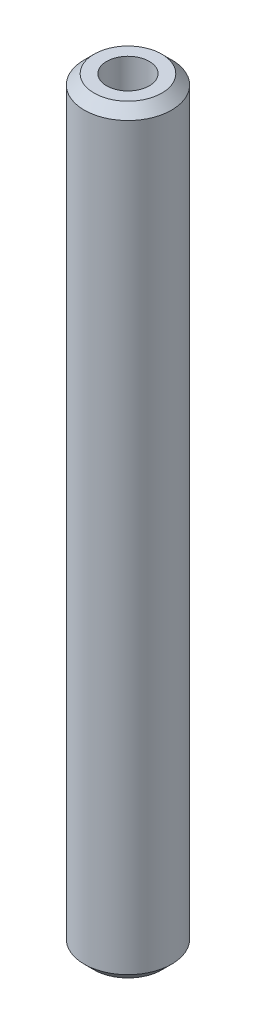
ISO-10303-21;
HEADER;
FILE_DESCRIPTION(('STEP AP214'),'2;1');
FILE_NAME('part.step','',(''),(''),'','','');
FILE_SCHEMA(('AUTOMOTIVE_DESIGN { 1 0 10303 214 1 1 1 1 }'));
ENDSEC;
DATA;
#1=APPLICATION_CONTEXT('core data for automotive mechanical design processes');
#2=APPLICATION_PROTOCOL_DEFINITION('international standard','automotive_design',2000,#1);
#3=PRODUCT_CONTEXT('',#1,'mechanical');
#4=PRODUCT('Part','Part','',(#3));
#5=PRODUCT_RELATED_PRODUCT_CATEGORY('part','',(#4));
#6=PRODUCT_DEFINITION_FORMATION('','',#4);
#7=PRODUCT_DEFINITION_CONTEXT('part definition',#1,'design');
#8=PRODUCT_DEFINITION('design','',#6,#7);
#9=PRODUCT_DEFINITION_SHAPE('','',#8);
#10=(LENGTH_UNIT() NAMED_UNIT(*) SI_UNIT(.MILLI.,.METRE.));
#11=(NAMED_UNIT(*) PLANE_ANGLE_UNIT() SI_UNIT($,.RADIAN.));
#12=(NAMED_UNIT(*) SI_UNIT($,.STERADIAN.) SOLID_ANGLE_UNIT());
#13=UNCERTAINTY_MEASURE_WITH_UNIT(LENGTH_MEASURE(1.E-05),#10,'distance_accuracy_value','');
#14=(GEOMETRIC_REPRESENTATION_CONTEXT(3) GLOBAL_UNCERTAINTY_ASSIGNED_CONTEXT((#13)) GLOBAL_UNIT_ASSIGNED_CONTEXT((#10,
#11,#12)) REPRESENTATION_CONTEXT('',''));
#15=CARTESIAN_POINT('',(0.,0.,0.));
#16=DIRECTION('',(0.,0.,1.));
#17=DIRECTION('',(1.,0.,0.));
#18=AXIS2_PLACEMENT_3D('',#15,#16,#17);
#19=CARTESIAN_POINT('',(0.,304.529368946112,0.));
#20=DIRECTION('',(0.,-1.,0.));
#21=DIRECTION('',(0.,0.,-1.));
#22=AXIS2_PLACEMENT_3D('',#19,#20,#21);
#23=CYLINDRICAL_SURFACE('',#22,17.5);
#24=CARTESIAN_POINT('',(0.,300.593678503799,0.));
#25=DIRECTION('',(0.,1.,0.));
#26=DIRECTION('',(0.,0.,1.));
#27=AXIS2_PLACEMENT_3D('',#24,#25,#26);
#28=CIRCLE('',#27,17.5);
#29=CARTESIAN_POINT('',(0.,300.593678503799,17.5));
#30=VERTEX_POINT('',#29);
#31=EDGE_CURVE('E50',#30,#30,#28,.F.);
#32=ORIENTED_EDGE('',*,*,#31,.T.);
#33=EDGE_LOOP('',(#32));
#34=FACE_BOUND('',#33,.T.);
#35=CARTESIAN_POINT('',(0.,3.93569044231279,0.));
#36=DIRECTION('',(0.,1.,0.));
#37=DIRECTION('',(0.,0.,1.));
#38=AXIS2_PLACEMENT_3D('',#35,#36,#37);
#39=CIRCLE('',#38,17.5);
#40=CARTESIAN_POINT('',(0.,3.93569044231279,17.5));
#41=VERTEX_POINT('',#40);
#42=EDGE_CURVE('E51',#41,#41,#39,.T.);
#43=ORIENTED_EDGE('',*,*,#42,.T.);
#44=EDGE_LOOP('',(#43));
#45=FACE_BOUND('',#44,.T.);
#46=ADVANCED_FACE('F39',(#34,#45),#23,.T.);
#47=CARTESIAN_POINT('',(0.,304.529368946112,0.));
#48=DIRECTION('',(0.,1.,0.));
#49=DIRECTION('',(0.,0.,1.));
#50=AXIS2_PLACEMENT_3D('',#47,#48,#49);
#51=PLANE('',#50);
#52=CARTESIAN_POINT('',(0.,304.529368946112,0.));
#53=DIRECTION('',(0.,1.,0.));
#54=DIRECTION('',(0.,0.,1.));
#55=AXIS2_PLACEMENT_3D('',#52,#53,#54);
#56=CIRCLE('',#55,13.5643095576873);
#57=CARTESIAN_POINT('',(0.,304.529368946112,13.5643095576873));
#58=VERTEX_POINT('',#57);
#59=EDGE_CURVE('E54',#58,#58,#56,.T.);
#60=ORIENTED_EDGE('',*,*,#59,.T.);
#61=EDGE_LOOP('',(#60));
#62=FACE_BOUND('',#61,.T.);
#63=CARTESIAN_POINT('',(0.,304.529368946112,0.));
#64=DIRECTION('',(0.,1.,0.));
#65=DIRECTION('',(0.,0.,1.));
#66=AXIS2_PLACEMENT_3D('',#63,#64,#65);
#67=CIRCLE('',#66,8.53633033487855);
#68=CARTESIAN_POINT('',(0.,304.529368946112,8.53633033487855));
#69=VERTEX_POINT('',#68);
#70=EDGE_CURVE('E58',#69,#69,#67,.T.);
#71=ORIENTED_EDGE('',*,*,#70,.F.);
#72=EDGE_LOOP('',(#71));
#73=FACE_BOUND('',#72,.T.);
#74=ADVANCED_FACE('F69',(#62,#73),#51,.T.);
#75=CARTESIAN_POINT('',(0.,0.,0.));
#76=DIRECTION('',(0.,1.,0.));
#77=DIRECTION('',(0.,0.,1.));
#78=AXIS2_PLACEMENT_3D('',#75,#76,#77);
#79=PLANE('',#78);
#80=CARTESIAN_POINT('',(0.,0.,0.));
#81=DIRECTION('',(0.,1.,0.));
#82=DIRECTION('',(0.,0.,1.));
#83=AXIS2_PLACEMENT_3D('',#80,#81,#82);
#84=CIRCLE('',#83,13.5643095576872);
#85=CARTESIAN_POINT('',(0.,0.,13.5643095576872));
#86=VERTEX_POINT('',#85);
#87=EDGE_CURVE('E10',#86,#86,#84,.F.);
#88=ORIENTED_EDGE('',*,*,#87,.T.);
#89=EDGE_LOOP('',(#88));
#90=FACE_BOUND('',#89,.T.);
#91=CARTESIAN_POINT('',(0.,0.,0.));
#92=DIRECTION('',(0.,1.,0.));
#93=DIRECTION('',(0.,0.,1.));
#94=AXIS2_PLACEMENT_3D('',#91,#92,#93);
#95=CIRCLE('',#94,8.53633033487855);
#96=CARTESIAN_POINT('',(0.,0.,8.53633033487855));
#97=VERTEX_POINT('',#96);
#98=EDGE_CURVE('E63',#97,#97,#95,.T.);
#99=ORIENTED_EDGE('',*,*,#98,.T.);
#100=EDGE_LOOP('',(#99));
#101=FACE_BOUND('',#100,.T.);
#102=ADVANCED_FACE('F75',(#90,#101),#79,.F.);
#103=CARTESIAN_POINT('',(0.,304.529368946112,0.));
#104=DIRECTION('',(0.,-1.,0.));
#105=DIRECTION('',(0.,0.,-1.));
#106=AXIS2_PLACEMENT_3D('',#103,#104,#105);
#107=CYLINDRICAL_SURFACE('',#106,8.53633033487855);
#108=ORIENTED_EDGE('',*,*,#70,.T.);
#109=EDGE_LOOP('',(#108));
#110=FACE_BOUND('',#109,.T.);
#111=ORIENTED_EDGE('',*,*,#98,.F.);
#112=EDGE_LOOP('',(#111));
#113=FACE_BOUND('',#112,.T.);
#114=ADVANCED_FACE('F70',(#110,#113),#107,.F.);
#115=CARTESIAN_POINT('',(0.,304.529368946112,0.));
#116=DIRECTION('',(0.,-1.,0.));
#117=DIRECTION('',(0.,0.,-1.));
#118=AXIS2_PLACEMENT_3D('',#115,#116,#117);
#119=CONICAL_SURFACE('',#118,13.5643095576873,0.785398163397443);
#120=ORIENTED_EDGE('',*,*,#31,.F.);
#121=EDGE_LOOP('',(#120));
#122=FACE_BOUND('',#121,.T.);
#123=ORIENTED_EDGE('',*,*,#59,.F.);
#124=EDGE_LOOP('',(#123));
#125=FACE_BOUND('',#124,.T.);
#126=ADVANCED_FACE('F81',(#122,#125),#119,.T.);
#127=CARTESIAN_POINT('',(0.,3.93569044231279,0.));
#128=DIRECTION('',(0.,1.,0.));
#129=DIRECTION('',(0.,0.,1.));
#130=AXIS2_PLACEMENT_3D('',#127,#128,#129);
#131=CONICAL_SURFACE('',#130,17.5,0.785398163397454);
#132=ORIENTED_EDGE('',*,*,#87,.F.);
#133=EDGE_LOOP('',(#132));
#134=FACE_BOUND('',#133,.T.);
#135=ORIENTED_EDGE('',*,*,#42,.F.);
#136=EDGE_LOOP('',(#135));
#137=FACE_BOUND('',#136,.T.);
#138=ADVANCED_FACE('F45',(#134,#137),#131,.T.);
#139=CLOSED_SHELL('',(#46,#74,#102,#114,#126,#138));
#140=MANIFOLD_SOLID_BREP('B2',#139);
#141=ADVANCED_BREP_SHAPE_REPRESENTATION('',(#18,#140),#14);
#142=SHAPE_DEFINITION_REPRESENTATION(#9,#141);
ENDSEC;
END-ISO-10303-21;
